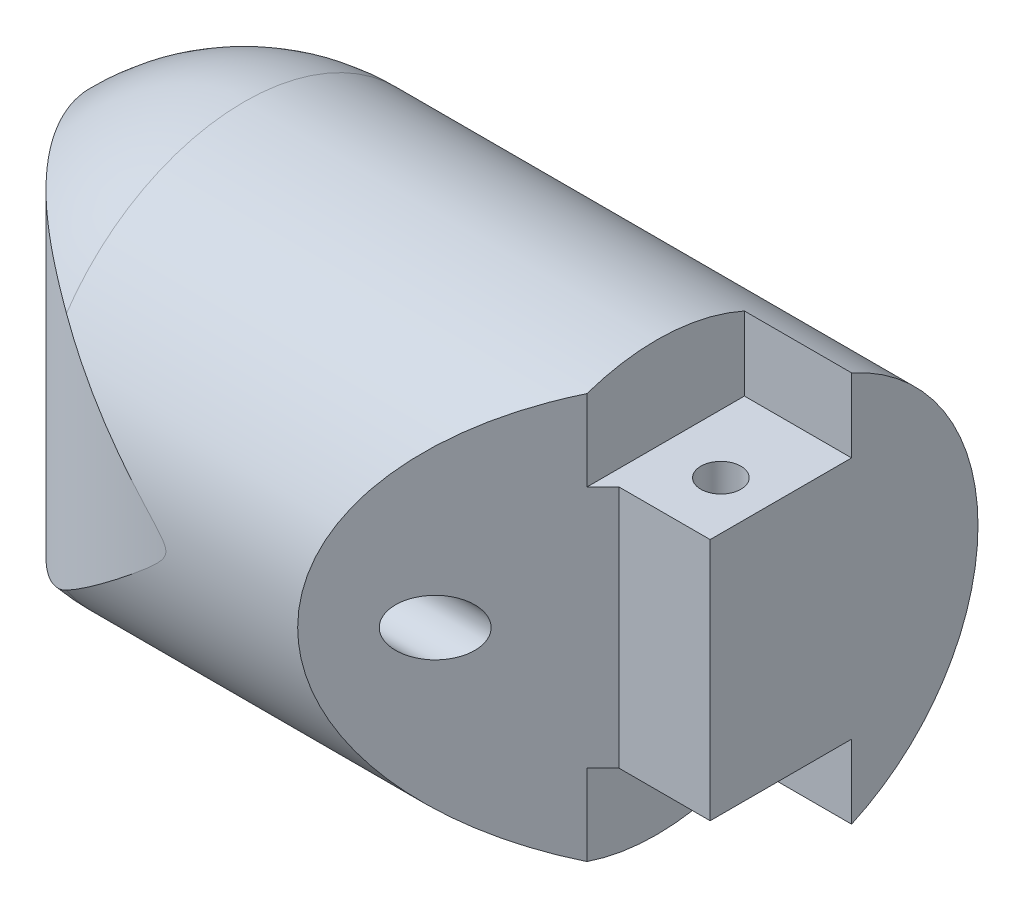
ISO-10303-21;
HEADER;
FILE_DESCRIPTION(('STEP AP214'),'2;1');
FILE_NAME('part.step','',(''),(''),'','','');
FILE_SCHEMA(('AUTOMOTIVE_DESIGN { 1 0 10303 214 1 1 1 1 }'));
ENDSEC;
DATA;
#1=APPLICATION_CONTEXT('core data for automotive mechanical design processes');
#2=APPLICATION_PROTOCOL_DEFINITION('international standard','automotive_design',2000,#1);
#3=PRODUCT_CONTEXT('',#1,'mechanical');
#4=PRODUCT('Part','Part','',(#3));
#5=PRODUCT_RELATED_PRODUCT_CATEGORY('part','',(#4));
#6=PRODUCT_DEFINITION_FORMATION('','',#4);
#7=PRODUCT_DEFINITION_CONTEXT('part definition',#1,'design');
#8=PRODUCT_DEFINITION('design','',#6,#7);
#9=PRODUCT_DEFINITION_SHAPE('','',#8);
#10=(LENGTH_UNIT() NAMED_UNIT(*) SI_UNIT(.MILLI.,.METRE.));
#11=(NAMED_UNIT(*) PLANE_ANGLE_UNIT() SI_UNIT($,.RADIAN.));
#12=(NAMED_UNIT(*) SI_UNIT($,.STERADIAN.) SOLID_ANGLE_UNIT());
#13=UNCERTAINTY_MEASURE_WITH_UNIT(LENGTH_MEASURE(1.E-05),#10,'distance_accuracy_value','');
#14=(GEOMETRIC_REPRESENTATION_CONTEXT(3) GLOBAL_UNCERTAINTY_ASSIGNED_CONTEXT((#13)) GLOBAL_UNIT_ASSIGNED_CONTEXT((#10,
#11,#12)) REPRESENTATION_CONTEXT('',''));
#15=CARTESIAN_POINT('',(0.,0.,0.));
#16=DIRECTION('',(0.,0.,1.));
#17=DIRECTION('',(1.,0.,0.));
#18=AXIS2_PLACEMENT_3D('',#15,#16,#17);
#19=CARTESIAN_POINT('',(17.6101649936008,1.61811043714822E-05,-0.164751686969172));
#20=DIRECTION('',(-1.,0.,0.));
#21=DIRECTION('',(0.,0.,1.));
#22=AXIS2_PLACEMENT_3D('',#19,#20,#21);
#23=CYLINDRICAL_SURFACE('',#22,8.);
#24=CARTESIAN_POINT('',(7.70519221882629,1.61811043714822E-05,7.83524831303083));
#25=VERTEX_POINT('',#24);
#26=VERTEX_LOOP('',#25);
#27=FACE_BOUND('',#26,.T.);
#28=DIRECTION('',(-1.,0.,0.));
#29=VECTOR('',#28,1.);
#30=CARTESIAN_POINT('',(17.6101649936008,-7.29666799734271,-3.44475168696917));
#31=LINE('',#30,#29);
#32=CARTESIAN_POINT('',(17.0101649936008,-7.29666799734271,-3.44475168696917));
#33=VERTEX_POINT('',#32);
#34=CARTESIAN_POINT('',(21.0101649936008,-7.29666799734271,-3.44475168696917));
#35=VERTEX_POINT('',#34);
#36=EDGE_CURVE('E139',#33,#35,#31,.F.);
#37=ORIENTED_EDGE('',*,*,#36,.F.);
#38=CARTESIAN_POINT('',(17.0101649936008,1.61811043714822E-05,-0.164751686969172));
#39=DIRECTION('',(1.,0.,0.));
#40=DIRECTION('',(0.,0.,-1.));
#41=AXIS2_PLACEMENT_3D('',#38,#39,#40);
#42=CIRCLE('',#41,8.);
#43=CARTESIAN_POINT('',(17.0101649936008,-7.56569594664672,2.43524831303084));
#44=VERTEX_POINT('',#43);
#45=EDGE_CURVE('E173',#44,#33,#42,.T.);
#46=ORIENTED_EDGE('',*,*,#45,.F.);
#47=CARTESIAN_POINT('',(19.6101649936008,1.61811043714822E-05,-0.164751686969172));
#48=DIRECTION('',(-0.707106781186552,0.,-0.707106781186544));
#49=DIRECTION('',(-0.707106781186544,0.,0.707106781186552));
#50=AXIS2_PLACEMENT_3D('',#47,#48,#49);
#51=ELLIPSE('',#50,11.3137084989847,8.);
#52=CARTESIAN_POINT('',(17.0101649936008,7.56572830885546,2.43524831303083));
#53=VERTEX_POINT('',#52);
#54=EDGE_CURVE('E53',#44,#53,#51,.T.);
#55=ORIENTED_EDGE('',*,*,#54,.T.);
#56=CARTESIAN_POINT('',(17.0101649936008,1.61811043714822E-05,-0.164751686969172));
#57=DIRECTION('',(1.,0.,0.));
#58=DIRECTION('',(0.,0.,-1.));
#59=AXIS2_PLACEMENT_3D('',#56,#57,#58);
#60=CIRCLE('',#59,8.);
#61=CARTESIAN_POINT('',(17.0101649936008,7.29670035955145,-3.44475168696917));
#62=VERTEX_POINT('',#61);
#63=EDGE_CURVE('E176',#62,#53,#60,.T.);
#64=ORIENTED_EDGE('',*,*,#63,.F.);
#65=DIRECTION('',(-1.,0.,0.));
#66=VECTOR('',#65,1.);
#67=CARTESIAN_POINT('',(17.6101649936008,7.29670035955145,-3.44475168696917));
#68=LINE('',#67,#66);
#69=CARTESIAN_POINT('',(21.0101649936008,7.29670035955145,-3.44475168696917));
#70=VERTEX_POINT('',#69);
#71=EDGE_CURVE('E159',#70,#62,#68,.T.);
#72=ORIENTED_EDGE('',*,*,#71,.F.);
#73=CARTESIAN_POINT('',(21.0101649936008,1.61811043714822E-05,-0.164751686969172));
#74=DIRECTION('',(1.,0.,0.));
#75=DIRECTION('',(0.,0.,-1.));
#76=AXIS2_PLACEMENT_3D('',#73,#74,#75);
#77=CIRCLE('',#76,8.);
#78=EDGE_CURVE('E185',#35,#70,#77,.T.);
#79=ORIENTED_EDGE('',*,*,#78,.F.);
#80=EDGE_LOOP('',(#37,#46,#55,#64,#72,#79));
#81=FACE_BOUND('',#80,.T.);
#82=CARTESIAN_POINT('',(1.61016499360084,1.71233530639071,-7.97935105054365));
#83=CARTESIAN_POINT('',(1.65725298118821,1.74075268129366,-7.97312301153596));
#84=CARTESIAN_POINT('',(1.70551800427946,1.76723142689343,-7.96716012932537));
#85=CARTESIAN_POINT('',(1.80413430495993,1.81615260314322,-7.95591855086394));
#86=CARTESIAN_POINT('',(1.8544858033116,1.83859460533137,-7.95063992725722));
#87=CARTESIAN_POINT('',(2.00815517248654,1.8995796656265,-7.93607247873761));
#88=CARTESIAN_POINT('',(2.11417865634026,1.93183651749961,-7.92803962544227));
#89=CARTESIAN_POINT('',(2.3304192470671,1.9784467364772,-7.91629336351326));
#90=CARTESIAN_POINT('',(2.44064143145067,1.99277766859026,-7.91258536799974));
#91=CARTESIAN_POINT('',(2.66194610572474,2.00299330831693,-7.90995105049467));
#92=CARTESIAN_POINT('',(2.77302803693621,1.99888913076955,-7.91102184728601));
#93=CARTESIAN_POINT('',(2.99116554098636,1.97259850098586,-7.91775710042299));
#94=CARTESIAN_POINT('',(3.09825659184325,1.95068623866359,-7.92335189454791));
#95=CARTESIAN_POINT('',(3.30723007269595,1.88983847261616,-7.9383959570226));
#96=CARTESIAN_POINT('',(3.40911064161346,1.85089693315935,-7.94784659192855));
#97=CARTESIAN_POINT('',(3.60614285830818,1.75659301793362,-7.9696730061742));
#98=CARTESIAN_POINT('',(3.7011985120869,1.70103822798487,-7.98208269565912));
#99=CARTESIAN_POINT('',(3.88079705995276,1.57524253597031,-8.00839754481537));
#100=CARTESIAN_POINT('',(3.96533912818908,1.50500048136832,-8.02230282180655));
#101=CARTESIAN_POINT('',(4.1240139925016,1.349469363457,-8.05052265156782));
#102=CARTESIAN_POINT('',(4.19778607628721,1.26381187792453,-8.06483768937494));
#103=CARTESIAN_POINT('',(4.32997208057947,1.08113581979395,-8.09190082120018));
#104=CARTESIAN_POINT('',(4.38838532796698,0.984116749530231,-8.10464884652908));
#105=CARTESIAN_POINT('',(4.48819323821953,0.781188947822655,-8.12717542834386));
#106=CARTESIAN_POINT('',(4.52956513873233,0.675268552529758,-8.13695000863527));
#107=CARTESIAN_POINT('',(4.59382016060902,0.457679949069797,-8.1523936223264));
#108=CARTESIAN_POINT('',(4.61670701028231,0.346012904798323,-8.15806348359618));
#109=CARTESIAN_POINT('',(4.6428541823851,0.123237345479737,-8.16455851049811));
#110=CARTESIAN_POINT('',(4.64661263300471,0.0121907416368236,-8.16550662225228));
#111=CARTESIAN_POINT('',(4.63572057996783,-0.208931447926665,-8.16278671717604));
#112=CARTESIAN_POINT('',(4.62107151508548,-0.319007108861211,-8.15911906112471));
#113=CARTESIAN_POINT('',(4.57417779959749,-0.533583397207488,-8.14765053606749));
#114=CARTESIAN_POINT('',(4.54216670183946,-0.638138247711567,-8.13990456781774));
#115=CARTESIAN_POINT('',(4.46170520164669,-0.84040042417791,-8.12113444149895));
#116=CARTESIAN_POINT('',(4.41325292568124,-0.938106968219617,-8.11010990984364));
#117=CARTESIAN_POINT('',(4.30021782929956,-1.12596078595223,-8.08569405073444));
#118=CARTESIAN_POINT('',(4.23534352068081,-1.21592718585016,-8.07226139348109));
#119=CARTESIAN_POINT('',(4.09171577167165,-1.38386932633363,-8.04460685967782));
#120=CARTESIAN_POINT('',(4.01296020566616,-1.46184322709744,-8.03038486248635));
#121=CARTESIAN_POINT('',(3.84158131391911,-1.60547529953047,-8.00234626858984));
#122=CARTESIAN_POINT('',(3.74867438974016,-1.6707991031831,-7.98854717983906));
#123=CARTESIAN_POINT('',(3.55290543007635,-1.78491413469106,-7.96330628490074));
#124=CARTESIAN_POINT('',(3.45004358459077,-1.83370567800057,-7.95186443373607));
#125=CARTESIAN_POINT('',(3.23807924114389,-1.91290701155149,-7.93278763036897));
#126=CARTESIAN_POINT('',(3.12903385334455,-1.9434620746124,-7.92512267907399));
#127=CARTESIAN_POINT('',(2.9071458090494,-1.98575404953757,-7.91440991300598));
#128=CARTESIAN_POINT('',(2.79430424686238,-1.99749633782719,-7.91136077911125));
#129=CARTESIAN_POINT('',(2.57148440207691,-2.00169998467868,-7.91027511913483));
#130=CARTESIAN_POINT('',(2.46151641736342,-1.99470259110886,-7.91209787785252));
#131=CARTESIAN_POINT('',(2.24436721410341,-1.96280204191048,-7.9202407507275));
#132=CARTESIAN_POINT('',(2.13718567245812,-1.93790097196375,-7.92656034102727));
#133=CARTESIAN_POINT('',(1.95885622751173,-1.88073034096929,-7.94057200488853));
#134=CARTESIAN_POINT('',(1.8862495683072,-1.85267260119402,-7.94733901993949));
#135=CARTESIAN_POINT('',(1.74503179734006,-1.78845043185946,-7.96234366957772));
#136=CARTESIAN_POINT('',(1.67641375926189,-1.75230061838877,-7.97057864730273));
#137=CARTESIAN_POINT('',(1.61016499360084,-1.71230294418197,-7.97935105054365));
#138=B_SPLINE_CURVE_WITH_KNOTS('',3,(#82,#83,#84,#85,#86,#87,#88,#89,#90,#91,#92,#93,#94,#95,
#96,#97,#98,#99,#100,#101,#102,#103,#104,#105,#106,#107,#108,#109,#110,#111,#112,#113,#114,#115,
#116,#117,#118,#119,#120,#121,#122,#123,#124,#125,#126,#127,#128,#129,#130,#131,#132,#133,#134,
#135,#136,#137),.UNSPECIFIED.,.F.,.F.,(4,2,2,2,2,2,2,2,2,2,2,2,2,2,2,2,2,2,2,2,2,2,2,2,2,2,2,4),
(0.,0.165953676128632,0.33192495627823,0.663551399347728,0.995592471988016,1.32743337833735,
1.65425962707504,1.98120180770854,2.31208781261516,2.64299979249547,2.98324217287823,
3.32349946230035,3.6642097755077,4.004851352583,4.33657507772737,4.66827287618812,
4.99561553137389,5.32299550095291,5.65665298089313,5.99036159773628,6.33195175535411,
6.67353539467921,7.01236032584674,7.35108840834994,7.68013946111097,8.00915218740687,
8.24304145915841,8.47651163554166),.UNSPECIFIED.);
#139=CARTESIAN_POINT('',(1.61016499360081,1.71233530639076,-7.97935105054365));
#140=VERTEX_POINT('',#139);
#141=CARTESIAN_POINT('',(1.61016499360084,-1.71230294418197,-7.97935105054365));
#142=VERTEX_POINT('',#141);
#143=EDGE_CURVE('E60',#140,#142,#138,.T.);
#144=ORIENTED_EDGE('',*,*,#143,.F.);
#145=CARTESIAN_POINT('',(1.61016499360084,1.61811043714822E-05,-0.164751686969172));
#146=DIRECTION('',(1.,0.,0.));
#147=DIRECTION('',(0.,0.,-1.));
#148=AXIS2_PLACEMENT_3D('',#145,#146,#147);
#149=CIRCLE('',#148,8.);
#150=CARTESIAN_POINT('',(1.61016499360084,4.47531782740553,6.46636248597447));
#151=VERTEX_POINT('',#150);
#152=EDGE_CURVE('E249',#140,#151,#149,.T.);
#153=ORIENTED_EDGE('',*,*,#152,.T.);
#154=CARTESIAN_POINT('',(1.61016499360084,-4.47528546519679,6.46636248597447));
#155=CARTESIAN_POINT('',(1.80213401584356,-4.32567854641755,6.56731529819537));
#156=CARTESIAN_POINT('',(1.99549902341133,-4.17393201223902,6.66237614848055));
#157=CARTESIAN_POINT('',(2.38455397087643,-3.86671474510934,6.84096108557073));
#158=CARTESIAN_POINT('',(2.58024368062027,-3.71124437930682,6.92448630427404));
#159=CARTESIAN_POINT('',(2.97376371317829,-3.39690931292307,7.08036384862137));
#160=CARTESIAN_POINT('',(3.17159639798209,-3.23804062692274,7.15270213282443));
#161=CARTESIAN_POINT('',(3.56872602429099,-2.91751661805304,7.28629870279307));
#162=CARTESIAN_POINT('',(3.76802292029855,-2.75586138156199,7.34755733133503));
#163=CARTESIAN_POINT('',(4.14563661574769,-2.44797370416302,7.4530457490555));
#164=CARTESIAN_POINT('',(4.32385002168903,-2.30200053012769,7.49840743635574));
#165=CARTESIAN_POINT('',(4.68065428986481,-2.00808690783486,7.58062147889897));
#166=CARTESIAN_POINT('',(4.859245198091,-1.86014620668173,7.61747272885409));
#167=CARTESIAN_POINT('',(5.21591119467358,-1.56225818996041,7.68270484473493));
#168=CARTESIAN_POINT('',(5.39398665193591,-1.41231374046635,7.71109668598665));
#169=CARTESIAN_POINT('',(5.65956093915709,-1.18466895457722,7.74741635915713));
#170=CARTESIAN_POINT('',(5.74781762911801,-1.10834296537341,7.75847718516285));
#171=CARTESIAN_POINT('',(5.92329102311056,-0.954241597294268,7.77851279693696));
#172=CARTESIAN_POINT('',(6.01050782254611,-0.876466353083919,7.78748777548879));
#173=CARTESIAN_POINT('',(6.14967695629961,-0.748502621566644,7.80030463787853));
#174=CARTESIAN_POINT('',(6.20233793540122,-0.699161134346354,7.80479575093919));
#175=CARTESIAN_POINT('',(6.3068597068592,-0.597935623699262,7.81303472056146));
#176=CARTESIAN_POINT('',(6.35869391667236,-0.546023436440655,7.8167694290254));
#177=CARTESIAN_POINT('',(6.45996946333775,-0.438097205368494,7.82343116385355));
#178=CARTESIAN_POINT('',(6.50936127031056,-0.382032062671681,7.82634477684155));
#179=CARTESIAN_POINT('',(6.57615975299841,-0.293055630478338,7.82993158873145));
#180=CARTESIAN_POINT('',(6.59707170485955,-0.262844861202245,7.83099114104619));
#181=CARTESIAN_POINT('',(6.63461873004748,-0.199898841624664,7.83281153390283));
#182=CARTESIAN_POINT('',(6.65127924489527,-0.167180208864048,7.83357416644827));
#183=CARTESIAN_POINT('',(6.66774902765042,-0.123106633953972,7.83430688016601));
#184=CARTESIAN_POINT('',(6.67111938382378,-0.113094365923109,7.83445502786565));
#185=CARTESIAN_POINT('',(6.67709696023047,-0.0928424453908621,7.83471581513946));
#186=CARTESIAN_POINT('',(6.67970399505316,-0.0826027382933075,7.83482844608714));
#187=CARTESIAN_POINT('',(6.68620230695076,-0.0516499828138604,7.83510787446901));
#188=CARTESIAN_POINT('',(6.68879658135396,-0.0306377908398137,7.83521733031133));
#189=CARTESIAN_POINT('',(6.68999072253248,0.0115966049167678,7.83526792726771));
#190=CARTESIAN_POINT('',(6.68857217342718,0.0328193300801802,7.83520829237791));
#191=CARTESIAN_POINT('',(6.68199335973271,0.0746971547539586,7.83492730383399));
#192=CARTESIAN_POINT('',(6.67682347473333,0.0953506528329866,7.83470553436996));
#193=CARTESIAN_POINT('',(6.6601935624995,0.146024815155526,7.83397420114377));
#194=CARTESIAN_POINT('',(6.64686670606852,0.175408977646341,7.83337532873784));
#195=CARTESIAN_POINT('',(6.6162854077636,0.232066114114863,7.83193265767974));
#196=CARTESIAN_POINT('',(6.59901340918607,0.259328897546218,7.83108775939648));
#197=CARTESIAN_POINT('',(6.5433397269479,0.339557796487792,7.82822182343742));
#198=CARTESIAN_POINT('',(6.50150279510386,0.390065848730843,7.8258858891344));
#199=CARTESIAN_POINT('',(6.41425829648675,0.487910481525721,7.82050552197558));
#200=CARTESIAN_POINT('',(6.36883931598877,0.535235954384343,7.81745875836704));
#201=CARTESIAN_POINT('',(6.22958198124902,0.674947927535177,7.80727828374814));
#202=CARTESIAN_POINT('',(6.13311622055641,0.764634376136404,7.79912210098064));
#203=CARTESIAN_POINT('',(5.84270350638561,1.02787213621334,7.77088867837542));
#204=CARTESIAN_POINT('',(5.64576658063189,1.19758065107802,7.74695738446443));
#205=CARTESIAN_POINT('',(5.25022514812977,1.53363040606878,7.68871169407128));
#206=CARTESIAN_POINT('',(5.0516191457879,1.69996803631812,7.65438673536339));
#207=CARTESIAN_POINT('',(4.65528010009374,2.02924966360804,7.57545361062191));
#208=CARTESIAN_POINT('',(4.45754742714262,2.19220609099918,7.53089543752892));
#209=CARTESIAN_POINT('',(4.06286630108253,2.51571489440394,7.43129124335486));
#210=CARTESIAN_POINT('',(3.86591760879371,2.67626805275948,7.37624871904001));
#211=CARTESIAN_POINT('',(3.4956276431109,2.97664653751983,7.26239073295578));
#212=CARTESIAN_POINT('',(3.3221564019935,3.11674699588992,7.20472204616289));
#213=CARTESIAN_POINT('',(2.97644891309551,3.39471761733661,7.08087807260623));
#214=CARTESIAN_POINT('',(2.80421272048135,3.5325876811285,7.01470240832599));
#215=CARTESIAN_POINT('',(2.46056996455086,3.80634839074364,6.87340628172035));
#216=CARTESIAN_POINT('',(2.28916966630594,3.94222864734924,6.79825037707639));
#217=CARTESIAN_POINT('',(1.94820877444614,4.21106325800459,6.63903087063321));
#218=CARTESIAN_POINT('',(1.77864827597713,4.34401746109467,6.55496681054333));
#219=CARTESIAN_POINT('',(1.61016499360084,4.47531782740553,6.46636248597447));
#220=B_SPLINE_CURVE_WITH_KNOTS('',3,(#154,#155,#156,#157,#158,#159,#160,#161,#162,#163,#164,
#165,#166,#167,#168,#169,#170,#171,#172,#173,#174,#175,#176,#177,#178,#179,#180,#181,#182,#183,
#184,#185,#186,#187,#188,#189,#190,#191,#192,#193,#194,#195,#196,#197,#198,#199,#200,#201,#202,
#203,#204,#205,#206,#207,#208,#209,#210,#211,#212,#213,#214,#215,#216,#217,#218,#219),
.UNSPECIFIED.,.F.,.F.,(4,2,2,2,2,2,2,2,2,2,2,2,2,2,2,2,2,2,2,2,2,2,2,2,2,2,2,2,2,2,2,2,4),(0.,
0.790347956737832,1.58061830783697,2.37187266516026,3.16310253889596,3.86730710463683,
4.57160307714849,5.27498126941964,5.62657722729656,5.97814067615178,6.19501186926937,
6.41537896921742,6.63916105284025,6.74929969246744,6.8587629065912,6.89043127660431,
6.92210733249045,6.98525065388525,7.04868422572916,7.112281052369,7.20853796750391,
7.30523189291532,7.5015504216489,7.69852194187429,8.09418094720072,8.87713545938584,
9.66088830933825,10.440890762936,11.2206335223028,11.9114222108256,12.6022415652565,
13.2958835009273,13.9895611391731),.UNSPECIFIED.);
#221=CARTESIAN_POINT('',(1.61016499360084,-4.47528546519679,6.46636248597448));
#222=VERTEX_POINT('',#221);
#223=EDGE_CURVE('E244',#222,#151,#220,.T.);
#224=ORIENTED_EDGE('',*,*,#223,.F.);
#225=EDGE_CURVE('E251',#222,#142,#149,.T.);
#226=ORIENTED_EDGE('',*,*,#225,.T.);
#227=EDGE_LOOP('',(#144,#153,#224,#226));
#228=FACE_BOUND('',#227,.T.);
#229=ADVANCED_FACE('F39',(#27,#81,#228),#23,.T.);
#230=CARTESIAN_POINT('',(1.61016499360085,1.61811043714822E-05,-0.164751686969172));
#231=DIRECTION('',(0.,1.,0.));
#232=DIRECTION('',(-1.,0.,0.));
#233=AXIS2_PLACEMENT_3D('',#230,#231,#232);
#234=SPHERICAL_SURFACE('',#233,8.);
#235=ORIENTED_EDGE('',*,*,#152,.F.);
#236=CARTESIAN_POINT('',(2.11798098571633,1.92971491773069,-7.91190508057218));
#237=CARTESIAN_POINT('',(2.0635833137763,1.91489757196481,-7.91916144716692));
#238=CARTESIAN_POINT('',(2.00982629292198,1.89778357553982,-7.92632205310035));
#239=CARTESIAN_POINT('',(1.90392228202673,1.8590688294976,-7.94040996156137));
#240=CARTESIAN_POINT('',(1.85177527411223,1.83746812971016,-7.94733726667903));
#241=CARTESIAN_POINT('',(1.69836978396877,1.7661552958558,-7.96768965350499));
#242=CARTESIAN_POINT('',(1.60000782806401,1.70989446180817,-7.98070373903571));
#243=CARTESIAN_POINT('',(1.41404267075822,1.58147501923293,-8.00525353643613));
#244=CARTESIAN_POINT('',(1.32644641438666,1.50930623134966,-8.01678829418754));
#245=CARTESIAN_POINT('',(1.16460537180713,1.35109128760913,-8.03805973358905));
#246=CARTESIAN_POINT('',(1.09035644472852,1.26504945149,-8.04779697292595));
#247=CARTESIAN_POINT('',(0.957794379076196,1.08204824152414,-8.06515598422951));
#248=CARTESIAN_POINT('',(0.899390483040538,0.985155738473425,-8.07278980828897));
#249=CARTESIAN_POINT('',(0.799677508387035,0.782779393426038,-8.08580961503332));
#250=CARTESIAN_POINT('',(0.758370716521238,0.677294404433814,-8.09119529702814));
#251=CARTESIAN_POINT('',(0.694370338838028,0.461644748423761,-8.09953506211925));
#252=CARTESIAN_POINT('',(0.671531567043521,0.351523888645237,-8.10250811274133));
#253=CARTESIAN_POINT('',(0.644606587379233,0.128984942909682,-8.10601273241574));
#254=CARTESIAN_POINT('',(0.640518267180204,0.0165671171502955,-8.10654457648184));
#255=CARTESIAN_POINT('',(0.651187378007772,-0.206840037043114,-8.10515613600312));
#256=CARTESIAN_POINT('',(0.665859168165837,-0.317833537321215,-8.10324699468442));
#257=CARTESIAN_POINT('',(0.71346464026571,-0.535767786372331,-8.0970473427116));
#258=CARTESIAN_POINT('',(0.746399182911573,-0.642708343880679,-8.09275671982077));
#259=CARTESIAN_POINT('',(0.829577688675768,-0.84957303230881,-8.08190687866808));
#260=CARTESIAN_POINT('',(0.879831131460456,-0.949493284462545,-8.07534641798093));
#261=CARTESIAN_POINT('',(0.996169959072261,-1.13946575036786,-8.06013350797537));
#262=CARTESIAN_POINT('',(1.06225515199958,-1.22951808371116,-8.05148108401405));
#263=CARTESIAN_POINT('',(1.20874654841812,-1.39774710281841,-8.03226247506785));
#264=CARTESIAN_POINT('',(1.2892302544212,-1.47585505136753,-8.02168592766808));
#265=CARTESIAN_POINT('',(1.46196512349662,-1.61746057550921,-7.99893311532617));
#266=CARTESIAN_POINT('',(1.55421406522149,-1.68096090277975,-7.98675715235039));
#267=CARTESIAN_POINT('',(1.72444831750497,-1.77828277501233,-7.96422932519712));
#268=CARTESIAN_POINT('',(1.80051457089648,-1.81556878441845,-7.9541448687278));
#269=CARTESIAN_POINT('',(1.95657859613042,-1.88018647991455,-7.93341233807662));
#270=CARTESIAN_POINT('',(2.03657138392828,-1.90753043289048,-7.92276497714398));
#271=CARTESIAN_POINT('',(2.11798098571633,-1.92968255552195,-7.91190508057218));
#272=B_SPLINE_CURVE_WITH_KNOTS('',3,(#236,#237,#238,#239,#240,#241,#242,#243,#244,#245,#246,
#247,#248,#249,#250,#251,#252,#253,#254,#255,#256,#257,#258,#259,#260,#261,#262,#263,#264,#265,
#266,#267,#268,#269,#270,#271),.UNSPECIFIED.,.F.,.F.,(4,2,2,2,2,2,2,2,2,2,2,2,2,2,2,2,2,4),(0.,
0.170430570465811,0.340859248213927,0.681286259418635,1.02193174244394,1.36247136066082,
1.70101714767581,2.0396082008535,2.37551081750098,2.71137559216105,3.04571258675616,
3.38006533963681,3.71460139514236,4.04913339587483,4.38552344011757,4.72185006565443,
4.97713665995373,5.23210719443881),.UNSPECIFIED.);
#273=EDGE_CURVE('E47',#140,#142,#272,.T.);
#274=ORIENTED_EDGE('',*,*,#273,.T.);
#275=ORIENTED_EDGE('',*,*,#225,.F.);
#276=CARTESIAN_POINT('',(1.61032499360068,-4.4751607794264,6.46644663206296));
#277=CARTESIAN_POINT('',(1.52954800612893,-4.53810762433188,6.42396774235228));
#278=CARTESIAN_POINT('',(1.44813262819111,-4.59918095846541,6.37997261573608));
#279=CARTESIAN_POINT('',(1.28432703212657,-4.71762046703394,6.28893124804707));
#280=CARTESIAN_POINT('',(1.20193688347153,-4.77498690379801,6.24188522335283));
#281=CARTESIAN_POINT('',(0.953834451867236,-4.94153508463717,6.09618908440344));
#282=CARTESIAN_POINT('',(0.787097091526689,-5.04523761071607,5.99293235466039));
#283=CARTESIAN_POINT('',(0.45349496207498,-5.23806256552588,5.77441136675883));
#284=CARTESIAN_POINT('',(0.28663063597748,-5.32720366050348,5.65916279629164));
#285=CARTESIAN_POINT('',(-0.0454503051649566,-5.49130028016092,5.41676848353668));
#286=CARTESIAN_POINT('',(-0.210666797065737,-5.56625475207525,5.28962185935975));
#287=CARTESIAN_POINT('',(-0.537477590246057,-5.70208061544204,5.02395232294196));
#288=CARTESIAN_POINT('',(-0.699074470146792,-5.76296234047899,4.88543786000511));
#289=CARTESIAN_POINT('',(-1.01712624739782,-5.87084224076245,4.59752545801724));
#290=CARTESIAN_POINT('',(-1.17358111968622,-5.9178403483498,4.44812746593184));
#291=CARTESIAN_POINT('',(-1.47986834632378,-5.99804352377846,4.13918783224011));
#292=CARTESIAN_POINT('',(-1.62970075742648,-6.0312487098436,3.97964627759124));
#293=CARTESIAN_POINT('',(-1.92143619660413,-6.08392789316647,3.65131184239996));
#294=CARTESIAN_POINT('',(-2.06333912435248,-6.10340171672638,3.48251884485855));
#295=CARTESIAN_POINT('',(-2.34033171896881,-6.12885887320929,3.13388546817821));
#296=CARTESIAN_POINT('',(-2.47527132944045,-6.1346155362854,2.95390923720223));
#297=CARTESIAN_POINT('',(-2.73477162515943,-6.13198756052868,2.58672082685375));
#298=CARTESIAN_POINT('',(-2.8593321833596,-6.12360274862053,2.39950855894791));
#299=CARTESIAN_POINT('',(-3.09726887564207,-6.09267564481086,2.01921806482911));
#300=CARTESIAN_POINT('',(-3.21064419218685,-6.07013231893889,1.82613941118475));
#301=CARTESIAN_POINT('',(-3.42558984960434,-6.01084627921888,1.43564106893847));
#302=CARTESIAN_POINT('',(-3.52716023075548,-5.97410361382082,1.23822139515084));
#303=CARTESIAN_POINT('',(-3.71809730009482,-5.88634884481689,0.840672564506474));
#304=CARTESIAN_POINT('',(-3.80746409842751,-5.83533687001257,0.640543432122107));
#305=CARTESIAN_POINT('',(-3.97381564602349,-5.71893827189183,0.239317248208087));
#306=CARTESIAN_POINT('',(-4.05080024769557,-5.65355147725485,0.0382201851704816));
#307=CARTESIAN_POINT('',(-4.19246977118641,-5.50821952531209,-0.363189021906106));
#308=CARTESIAN_POINT('',(-4.25714776570597,-5.4282662178934,-0.563500662075356));
#309=CARTESIAN_POINT('',(-4.37442437110244,-5.25364226362681,-0.961224807226229));
#310=CARTESIAN_POINT('',(-4.42702328389217,-5.15897198472416,-1.15863738455354));
#311=CARTESIAN_POINT('',(-4.5204752800023,-4.95508548158123,-1.54765712130877));
#312=CARTESIAN_POINT('',(-4.56137351555666,-4.84592762001684,-1.73928397320286));
#313=CARTESIAN_POINT('',(-4.63245774311188,-4.61251796125048,-2.11524359393822));
#314=CARTESIAN_POINT('',(-4.66264241291386,-4.48826430356135,-2.29957545998713));
#315=CARTESIAN_POINT('',(-4.71327542699564,-4.22456655397672,-2.65816249107272));
#316=CARTESIAN_POINT('',(-4.73373519162064,-4.08514051736851,-2.83242926352612));
#317=CARTESIAN_POINT('',(-4.76624794543997,-3.79089729237711,-3.16815448843756));
#318=CARTESIAN_POINT('',(-4.7783046600937,-3.63608695938895,-3.32961858873583));
#319=CARTESIAN_POINT('',(-4.79890615910192,-3.24801539008701,-3.69608244369888));
#320=CARTESIAN_POINT('',(-4.80429252068503,-3.00755880368793,-3.89378884203963));
#321=CARTESIAN_POINT('',(-4.8068470880075,-2.49835060966063,-4.24839612483797));
#322=CARTESIAN_POINT('',(-4.80402834012531,-2.229644574664,-4.40536135657468));
#323=CARTESIAN_POINT('',(-4.79640435122581,-1.71331346165794,-4.64671897741269));
#324=CARTESIAN_POINT('',(-4.79199231993339,-1.4692667072732,-4.73872932876129));
#325=CARTESIAN_POINT('',(-4.78427739995413,-0.969147778044819,-4.88060789810472));
#326=CARTESIAN_POINT('',(-4.78097380276493,-0.713083404555505,-4.93050306682928));
#327=CARTESIAN_POINT('',(-4.77737664632059,-0.195200616124311,-4.98442092522241));
#328=CARTESIAN_POINT('',(-4.77709321063494,0.066634204993238,-4.98828933843593));
#329=CARTESIAN_POINT('',(-4.77972404226151,0.586788586137389,-4.94941830845663));
#330=CARTESIAN_POINT('',(-4.78263872066876,0.845107689921638,-4.90667287338664));
#331=CARTESIAN_POINT('',(-4.7898008140921,1.33794747129549,-4.78122888072201));
#332=CARTESIAN_POINT('',(-4.79397486177762,1.57301293888479,-4.7006196931296));
#333=CARTESIAN_POINT('',(-4.80122612044054,2.02857222080183,-4.50531220873093));
#334=CARTESIAN_POINT('',(-4.80430271939509,2.24905784862027,-4.39059495578722));
#335=CARTESIAN_POINT('',(-4.80620196703979,2.60748544994956,-4.17235909832299));
#336=CARTESIAN_POINT('',(-4.80603996355874,2.75000224238165,-4.07619826485699));
#337=CARTESIAN_POINT('',(-4.80292309196355,3.02628075931012,-3.87197747132461));
#338=CARTESIAN_POINT('',(-4.79996732407802,3.16003964835911,-3.76391368765086));
#339=CARTESIAN_POINT('',(-4.79040590162788,3.41860547201113,-3.53751463110388));
#340=CARTESIAN_POINT('',(-4.78379674527624,3.54340368789935,-3.41916959548079));
#341=CARTESIAN_POINT('',(-4.76615634100358,3.78389557330405,-3.17380166916843));
#342=CARTESIAN_POINT('',(-4.75512334035906,3.89958561240784,-3.04677535553124));
#343=CARTESIAN_POINT('',(-4.72775879094037,4.12350550436097,-2.78354039593603));
#344=CARTESIAN_POINT('',(-4.71135013788808,4.23159718538266,-2.64722247866514));
#345=CARTESIAN_POINT('',(-4.67267625559507,4.43850219278078,-2.36844544357314));
#346=CARTESIAN_POINT('',(-4.65040883943281,4.53731203576318,-2.22598404919152));
#347=CARTESIAN_POINT('',(-4.59953039647845,4.72568120127795,-1.93626525186664));
#348=CARTESIAN_POINT('',(-4.57092230423925,4.81524477509594,-1.78901009435279));
#349=CARTESIAN_POINT('',(-4.50695270536567,4.98529883058344,-1.49077008446028));
#350=CARTESIAN_POINT('',(-4.47159060935178,5.06578851945646,-1.33978490758809));
#351=CARTESIAN_POINT('',(-4.38599320992062,5.23305685535658,-1.00458110117451));
#352=CARTESIAN_POINT('',(-4.33419735865571,5.31785942193447,-0.819770184141929));
#353=CARTESIAN_POINT('',(-4.22004406936265,5.47472202729532,-0.448004044671667));
#354=CARTESIAN_POINT('',(-4.15768547535584,5.54678066962653,-0.261048589627341));
#355=CARTESIAN_POINT('',(-4.02217964993634,5.67833249621213,0.113513236080808));
#356=CARTESIAN_POINT('',(-3.9490260361995,5.73781819602902,0.301119927258813));
#357=CARTESIAN_POINT('',(-3.79194424262372,5.84428150889546,0.675367721467672));
#358=CARTESIAN_POINT('',(-3.70801588183439,5.89125891184077,0.862008808227453));
#359=CARTESIAN_POINT('',(-3.52372854203183,5.9754418828205,1.24498248022892));
#360=CARTESIAN_POINT('',(-3.42265599021233,6.01181328411011,1.44115597881387));
#361=CARTESIAN_POINT('',(-3.20885036712436,6.07053121073245,1.82920928006008));
#362=CARTESIAN_POINT('',(-3.09611671159482,6.09287703293899,2.02108886699528));
#363=CARTESIAN_POINT('',(-2.85960021324968,6.12358093461375,2.3990507472812));
#364=CARTESIAN_POINT('',(-2.73581824136203,6.13194011561122,2.58513349603372));
#365=CARTESIAN_POINT('',(-2.47799767629695,6.13468849056144,2.95015634419751));
#366=CARTESIAN_POINT('',(-2.34395918423987,6.12907782222752,3.12909651400193));
#367=CARTESIAN_POINT('',(-2.0657366793792,6.10379737200728,3.47971862197014));
#368=CARTESIAN_POINT('',(-1.92149394011275,6.0840390258506,3.6513475851959));
#369=CARTESIAN_POINT('',(-1.62481649205504,6.03032964652514,3.98504090575516));
#370=CARTESIAN_POINT('',(-1.47238168441634,5.99637844206843,4.14710514762892));
#371=CARTESIAN_POINT('',(-1.16069592912796,5.91421787714106,4.46073368323678));
#372=CARTESIAN_POINT('',(-1.00144478658986,5.86600810876517,4.61229767642942));
#373=CARTESIAN_POINT('',(-0.677690392843834,5.75523396882762,4.90414866712932));
#374=CARTESIAN_POINT('',(-0.513187230013924,5.69266983870354,5.04443585425667));
#375=CARTESIAN_POINT('',(-0.185515177220197,5.55508618117838,5.30922231432099));
#376=CARTESIAN_POINT('',(-0.0224470197206149,5.48048258734047,5.43406245634213));
#377=CARTESIAN_POINT('',(0.305210502822624,5.31746784244489,5.67215314523989));
#378=CARTESIAN_POINT('',(0.46979971604077,5.22905805575422,5.78540483549148));
#379=CARTESIAN_POINT('',(0.798755019411813,5.03810939590211,6.00022738348513));
#380=CARTESIAN_POINT('',(0.96312070456412,4.93555604941061,6.10178607772045));
#381=CARTESIAN_POINT('',(1.20769851535929,4.77103306564391,6.24519198866439));
#382=CARTESIAN_POINT('',(1.28891926437282,4.71439193451377,6.29151740670628));
#383=CARTESIAN_POINT('',(1.45040871063431,4.59750555601225,6.38120229456211));
#384=CARTESIAN_POINT('',(1.53067734192487,4.53726006067777,6.42456155987803));
#385=CARTESIAN_POINT('',(1.61032499360067,4.47519314163515,6.46644663206296));
#386=B_SPLINE_CURVE_WITH_KNOTS('',3,(#276,#277,#278,#279,#280,#281,#282,#283,#284,#285,#286,
#287,#288,#289,#290,#291,#292,#293,#294,#295,#296,#297,#298,#299,#300,#301,#302,#303,#304,#305,
#306,#307,#308,#309,#310,#311,#312,#313,#314,#315,#316,#317,#318,#319,#320,#321,#322,#323,#324,
#325,#326,#327,#328,#329,#330,#331,#332,#333,#334,#335,#336,#337,#338,#339,#340,#341,#342,#343,
#344,#345,#346,#347,#348,#349,#350,#351,#352,#353,#354,#355,#356,#357,#358,#359,#360,#361,#362,
#363,#364,#365,#366,#367,#368,#369,#370,#371,#372,#373,#374,#375,#376,#377,#378,#379,#380,#381,
#382,#383,#384,#385),.UNSPECIFIED.,.F.,.F.,(4,2,2,2,2,2,2,2,2,2,2,2,2,2,2,2,2,2,2,2,2,2,2,2,2,2,
2,2,2,2,2,2,2,2,2,2,2,2,2,2,2,2,2,2,2,2,2,2,2,2,2,2,2,2,4),(0.,0.33254252924866,
0.665061499353749,1.32971899105246,1.99351765853064,2.65736556609828,3.32072445212153,
3.9840865708449,4.64744300354781,5.31080782737021,5.98506066638044,6.65932175752591,
7.33363209445505,8.00794013057033,8.68224208025782,9.35655206677927,10.0312405018105,
10.7059120713815,11.3779438787764,12.0500585951685,12.7213820582903,13.3924077031247,
14.3227848929405,15.2516835626369,16.0309269896891,16.8096713773441,17.5910252952219,
18.3724796624038,19.115129078698,19.858192009011,20.3733383159349,20.8886505895734,
21.4044576506454,21.920469276308,22.4442323455431,22.9681911997527,23.4919080630255,
24.0156706486791,24.6444740500193,25.2733463116467,25.9025918813401,26.5318480199251,
27.2020263310227,27.8722382366189,28.5423973566491,29.2125498703457,29.886934623167,
30.5613275151034,31.2357397017597,31.9101405457655,32.564895313408,33.2195854172324,
33.8749505167903,34.2028232632341,34.5307185917558),.UNSPECIFIED.);
#387=EDGE_CURVE('E225',#222,#151,#386,.T.);
#388=ORIENTED_EDGE('',*,*,#387,.T.);
#389=EDGE_LOOP('',(#235,#274,#275,#388));
#390=FACE_BOUND('',#389,.T.);
#391=ADVANCED_FACE('F231',(#390),#234,.T.);
#392=CARTESIAN_POINT('',(7.19736004359885,9.60001618110437,-4.15724323268306));
#393=DIRECTION('',(0.,-1.,0.));
#394=DIRECTION('',(0.,0.,-1.));
#395=AXIS2_PLACEMENT_3D('',#392,#393,#394);
#396=CYLINDRICAL_SURFACE('',#395,12.0032390208733);
#397=ORIENTED_EDGE('',*,*,#223,.T.);
#398=ORIENTED_EDGE('',*,*,#387,.F.);
#399=EDGE_LOOP('',(#397,#398));
#400=FACE_BOUND('',#399,.T.);
#401=ADVANCED_FACE('F234',(#400),#396,.T.);
#402=CARTESIAN_POINT('',(2.64358804984579,1.61811043714822E-05,-2.73217015261755));
#403=DIRECTION('',(0.,0.,-1.));
#404=DIRECTION('',(-1.,0.,0.));
#405=AXIS2_PLACEMENT_3D('',#402,#403,#404);
#406=CYLINDRICAL_SURFACE('',#405,1.044);
#407=CARTESIAN_POINT('',(2.64358804984579,1.61811043714822E-05,-2.73217015261755));
#408=DIRECTION('',(0.,0.,1.));
#409=DIRECTION('',(1.,0.,0.));
#410=AXIS2_PLACEMENT_3D('',#407,#408,#409);
#411=CIRCLE('',#410,1.044);
#412=CARTESIAN_POINT('',(1.59958804984578,1.61811043714822E-05,-2.73217015261756));
#413=VERTEX_POINT('',#412);
#414=EDGE_CURVE('E250',#413,#413,#411,.T.);
#415=ORIENTED_EDGE('',*,*,#414,.T.);
#416=EDGE_LOOP('',(#415));
#417=FACE_BOUND('',#416,.T.);
#418=CARTESIAN_POINT('',(2.64358804984579,1.61811043714822E-05,-5.1321701526175));
#419=DIRECTION('',(0.,0.,1.));
#420=DIRECTION('',(1.,0.,0.));
#421=AXIS2_PLACEMENT_3D('',#418,#419,#420);
#422=CIRCLE('',#421,1.044);
#423=CARTESIAN_POINT('',(3.68758804984579,1.61811043714822E-05,-5.1321701526175));
#424=VERTEX_POINT('',#423);
#425=EDGE_CURVE('E199',#424,#424,#422,.T.);
#426=ORIENTED_EDGE('',*,*,#425,.F.);
#427=EDGE_LOOP('',(#426));
#428=FACE_BOUND('',#427,.T.);
#429=ADVANCED_FACE('F240',(#417,#428),#406,.F.);
#430=CARTESIAN_POINT('',(10.6435880498458,1.61811043714822E-05,-2.7321701526175));
#431=DIRECTION('',(0.,-1.,0.));
#432=DIRECTION('',(0.,0.,-1.));
#433=AXIS2_PLACEMENT_3D('',#430,#431,#432);
#434=TOROIDAL_SURFACE('',#433,8.,1.044);
#435=CARTESIAN_POINT('',(10.6435880498458,1.61811043714822E-05,5.2678298473825));
#436=DIRECTION('',(1.,0.,0.));
#437=DIRECTION('',(0.,0.,-1.));
#438=AXIS2_PLACEMENT_3D('',#435,#436,#437);
#439=CIRCLE('',#438,1.044);
#440=CARTESIAN_POINT('',(10.6435880498458,1.61811043714822E-05,6.3118298473825));
#441=VERTEX_POINT('',#440);
#442=EDGE_CURVE('E207',#441,#441,#439,.T.);
#443=CARTESIAN_POINT('',(10.6435880498458,1.61811043714822E-05,-2.7321701526175));
#444=DIRECTION('',(0.,-1.,0.));
#445=DIRECTION('',(0.,0.,-1.));
#446=AXIS2_PLACEMENT_3D('',#443,#444,#445);
#447=CIRCLE('',#446,9.044);
#448=EDGE_CURVE('',#441,#413,#447,.T.);
#449=ORIENTED_EDGE('',*,*,#442,.T.);
#450=ORIENTED_EDGE('',*,*,#414,.F.);
#451=ORIENTED_EDGE('',*,*,#448,.T.);
#452=ORIENTED_EDGE('',*,*,#448,.F.);
#453=EDGE_LOOP('',(#449,#451,#450,#452));
#454=FACE_BOUND('',#453,.T.);
#455=ADVANCED_FACE('F287',(#454),#434,.F.);
#456=CARTESIAN_POINT('',(10.6435880498458,1.61811043714822E-05,5.2678298473825));
#457=DIRECTION('',(1.,0.,0.));
#458=DIRECTION('',(0.,0.,-1.));
#459=AXIS2_PLACEMENT_3D('',#456,#457,#458);
#460=CYLINDRICAL_SURFACE('',#459,1.044);
#461=CARTESIAN_POINT('',(14.1775834592492,1.61811043714822E-05,5.2678298473825));
#462=DIRECTION('',(-0.707106781186552,0.,-0.707106781186544));
#463=DIRECTION('',(0.707106781186544,0.,-0.707106781186552));
#464=AXIS2_PLACEMENT_3D('',#461,#462,#463);
#465=ELLIPSE('',#464,1.4764389591175,1.044);
#466=CARTESIAN_POINT('',(15.2215834592492,1.61811043714822E-05,4.2238298473825));
#467=VERTEX_POINT('',#466);
#468=EDGE_CURVE('E170',#467,#467,#465,.F.);
#469=ORIENTED_EDGE('',*,*,#468,.T.);
#470=EDGE_LOOP('',(#469));
#471=FACE_BOUND('',#470,.T.);
#472=ORIENTED_EDGE('',*,*,#442,.F.);
#473=EDGE_LOOP('',(#472));
#474=FACE_BOUND('',#473,.T.);
#475=ADVANCED_FACE('F215',(#471,#474),#460,.F.);
#476=CARTESIAN_POINT('',(2.64358804984579,1.61811043714822E-05,-5.1321701526175));
#477=DIRECTION('',(0.,0.,-1.));
#478=DIRECTION('',(-1.,0.,0.));
#479=AXIS2_PLACEMENT_3D('',#476,#477,#478);
#480=CYLINDRICAL_SURFACE('',#479,2.);
#481=CARTESIAN_POINT('',(2.64358804984579,1.61811043714822E-05,-5.1321701526175));
#482=DIRECTION('',(0.,0.,1.));
#483=DIRECTION('',(1.,0.,0.));
#484=AXIS2_PLACEMENT_3D('',#481,#482,#483);
#485=CIRCLE('',#484,2.);
#486=CARTESIAN_POINT('',(4.64358804984579,1.61811043714822E-05,-5.1321701526175));
#487=VERTEX_POINT('',#486);
#488=EDGE_CURVE('E196',#487,#487,#485,.T.);
#489=ORIENTED_EDGE('',*,*,#488,.T.);
#490=EDGE_LOOP('',(#489));
#491=FACE_BOUND('',#490,.T.);
#492=ORIENTED_EDGE('',*,*,#143,.T.);
#493=ORIENTED_EDGE('',*,*,#273,.F.);
#494=EDGE_LOOP('',(#492,#493));
#495=FACE_BOUND('',#494,.T.);
#496=ADVANCED_FACE('F209',(#491,#495),#480,.F.);
#497=CARTESIAN_POINT('',(2.64358804984579,1.61811043714822E-05,-5.1321701526175));
#498=DIRECTION('',(0.,0.,1.));
#499=DIRECTION('',(1.,0.,0.));
#500=AXIS2_PLACEMENT_3D('',#497,#498,#499);
#501=PLANE('',#500);
#502=ORIENTED_EDGE('',*,*,#425,.T.);
#503=EDGE_LOOP('',(#502));
#504=FACE_BOUND('',#503,.T.);
#505=ORIENTED_EDGE('',*,*,#488,.F.);
#506=EDGE_LOOP('',(#505));
#507=FACE_BOUND('',#506,.T.);
#508=ADVANCED_FACE('F214',(#504,#507),#501,.F.);
#509=CARTESIAN_POINT('',(21.0101649936008,-4.54595051131046,1.83524831303083));
#510=DIRECTION('',(0.,1.,0.));
#511=DIRECTION('',(0.,0.,1.));
#512=AXIS2_PLACEMENT_3D('',#509,#510,#511);
#513=PLANE('',#512);
#514=CARTESIAN_POINT('',(19.2101649936008,-4.54595051131046,-0.364751686969172));
#515=DIRECTION('',(0.,1.,0.));
#516=DIRECTION('',(0.,0.,1.));
#517=AXIS2_PLACEMENT_3D('',#514,#515,#516);
#518=CIRCLE('',#517,0.748000000000002);
#519=CARTESIAN_POINT('',(19.2101649936008,-4.54595051131046,0.38324831303083));
#520=VERTEX_POINT('',#519);
#521=EDGE_CURVE('E182',#520,#520,#518,.T.);
#522=ORIENTED_EDGE('',*,*,#521,.T.);
#523=EDGE_LOOP('',(#522));
#524=FACE_BOUND('',#523,.T.);
#525=DIRECTION('',(-1.,0.,0.));
#526=VECTOR('',#525,1.);
#527=CARTESIAN_POINT('',(21.0101649936008,-4.54595051131046,1.83524831303083));
#528=LINE('',#527,#526);
#529=CARTESIAN_POINT('',(21.0101649936008,-4.54595051131046,1.83524831303083));
#530=VERTEX_POINT('',#529);
#531=CARTESIAN_POINT('',(17.6101649936008,-4.54595051131046,1.83524831303083));
#532=VERTEX_POINT('',#531);
#533=EDGE_CURVE('E189',#530,#532,#528,.T.);
#534=ORIENTED_EDGE('',*,*,#533,.T.);
#535=DIRECTION('',(-0.707106781186544,0.,0.707106781186552));
#536=VECTOR('',#535,1.);
#537=CARTESIAN_POINT('',(19.3101649936008,-4.54595051131046,0.135248313030829));
#538=LINE('',#537,#536);
#539=CARTESIAN_POINT('',(17.0101649936008,-4.54595051131046,2.43524831303084));
#540=VERTEX_POINT('',#539);
#541=EDGE_CURVE('E162',#532,#540,#538,.T.);
#542=ORIENTED_EDGE('',*,*,#541,.T.);
#543=DIRECTION('',(0.,0.,1.));
#544=VECTOR('',#543,1.);
#545=CARTESIAN_POINT('',(17.0101649936008,-4.54595051131046,-2.16475168696917));
#546=LINE('',#545,#544);
#547=CARTESIAN_POINT('',(17.0101649936008,-4.54595051131046,-3.44475168696917));
#548=VERTEX_POINT('',#547);
#549=EDGE_CURVE('E144',#548,#540,#546,.T.);
#550=ORIENTED_EDGE('',*,*,#549,.F.);
#551=DIRECTION('',(-1.,0.,0.));
#552=VECTOR('',#551,1.);
#553=CARTESIAN_POINT('',(21.0101649936008,-4.54595051131046,-3.44475168696917));
#554=LINE('',#553,#552);
#555=CARTESIAN_POINT('',(21.0101649936008,-4.54595051131046,-3.44475168696917));
#556=VERTEX_POINT('',#555);
#557=EDGE_CURVE('E136',#556,#548,#554,.T.);
#558=ORIENTED_EDGE('',*,*,#557,.F.);
#559=DIRECTION('',(0.,0.,-1.));
#560=VECTOR('',#559,1.);
#561=CARTESIAN_POINT('',(21.0101649936008,-4.54595051131046,1.83524831303083));
#562=LINE('',#561,#560);
#563=EDGE_CURVE('E118',#530,#556,#562,.T.);
#564=ORIENTED_EDGE('',*,*,#563,.F.);
#565=EDGE_LOOP('',(#534,#542,#550,#558,#564));
#566=FACE_BOUND('',#565,.T.);
#567=ADVANCED_FACE('F141',(#524,#566),#513,.F.);
#568=CARTESIAN_POINT('',(21.0101649936008,4.54598287351921,1.83524831303083));
#569=DIRECTION('',(0.,-1.,0.));
#570=DIRECTION('',(0.,0.,-1.));
#571=AXIS2_PLACEMENT_3D('',#568,#569,#570);
#572=PLANE('',#571);
#573=CARTESIAN_POINT('',(19.2101649936008,4.5459828735192,-0.364751686969172));
#574=DIRECTION('',(0.,-1.,0.));
#575=DIRECTION('',(0.,0.,-1.));
#576=AXIS2_PLACEMENT_3D('',#573,#574,#575);
#577=CIRCLE('',#576,0.748000000000002);
#578=CARTESIAN_POINT('',(19.2101649936008,4.5459828735192,-1.11275168696917));
#579=VERTEX_POINT('',#578);
#580=EDGE_CURVE('E181',#579,#579,#577,.T.);
#581=ORIENTED_EDGE('',*,*,#580,.T.);
#582=EDGE_LOOP('',(#581));
#583=FACE_BOUND('',#582,.T.);
#584=DIRECTION('',(0.,0.,-1.));
#585=VECTOR('',#584,1.);
#586=CARTESIAN_POINT('',(17.0101649936008,4.54598287351921,6.41811902659151));
#587=LINE('',#586,#585);
#588=CARTESIAN_POINT('',(17.0101649936008,4.54598287351921,2.43524831303084));
#589=VERTEX_POINT('',#588);
#590=CARTESIAN_POINT('',(17.0101649936008,4.54598287351921,-3.44475168696917));
#591=VERTEX_POINT('',#590);
#592=EDGE_CURVE('E179',#589,#591,#587,.T.);
#593=ORIENTED_EDGE('',*,*,#592,.F.);
#594=DIRECTION('',(0.707106781186544,0.,-0.707106781186552));
#595=VECTOR('',#594,1.);
#596=CARTESIAN_POINT('',(19.3101649936008,4.54598287351921,0.135248313030829));
#597=LINE('',#596,#595);
#598=CARTESIAN_POINT('',(17.6101649936008,4.5459828735192,1.83524831303083));
#599=VERTEX_POINT('',#598);
#600=EDGE_CURVE('E167',#589,#599,#597,.T.);
#601=ORIENTED_EDGE('',*,*,#600,.T.);
#602=DIRECTION('',(-1.,0.,0.));
#603=VECTOR('',#602,1.);
#604=CARTESIAN_POINT('',(21.0101649936008,4.54598287351921,1.83524831303083));
#605=LINE('',#604,#603);
#606=CARTESIAN_POINT('',(21.0101649936008,4.54598287351921,1.83524831303083));
#607=VERTEX_POINT('',#606);
#608=EDGE_CURVE('E193',#607,#599,#605,.T.);
#609=ORIENTED_EDGE('',*,*,#608,.F.);
#610=DIRECTION('',(0.,0.,1.));
#611=VECTOR('',#610,1.);
#612=CARTESIAN_POINT('',(21.0101649936008,4.54598287351921,1.83524831303083));
#613=LINE('',#612,#611);
#614=CARTESIAN_POINT('',(21.0101649936008,4.54598287351921,-3.44475168696917));
#615=VERTEX_POINT('',#614);
#616=EDGE_CURVE('E129',#615,#607,#613,.T.);
#617=ORIENTED_EDGE('',*,*,#616,.F.);
#618=DIRECTION('',(1.,0.,0.));
#619=VECTOR('',#618,1.);
#620=CARTESIAN_POINT('',(17.0101649936008,4.54598287351921,-3.44475168696917));
#621=LINE('',#620,#619);
#622=EDGE_CURVE('E156',#591,#615,#621,.T.);
#623=ORIENTED_EDGE('',*,*,#622,.F.);
#624=EDGE_LOOP('',(#593,#601,#609,#617,#623));
#625=FACE_BOUND('',#624,.T.);
#626=ADVANCED_FACE('F272',(#583,#625),#572,.F.);
#627=CARTESIAN_POINT('',(21.0101649936008,-4.54595051131046,1.83524831303083));
#628=DIRECTION('',(0.,0.,-1.));
#629=DIRECTION('',(-1.,0.,0.));
#630=AXIS2_PLACEMENT_3D('',#627,#628,#629);
#631=PLANE('',#630);
#632=DIRECTION('',(0.,-1.,0.));
#633=VECTOR('',#632,1.);
#634=CARTESIAN_POINT('',(17.6101649936008,-4.54595051131046,1.83524831303083));
#635=LINE('',#634,#633);
#636=EDGE_CURVE('E130',#599,#532,#635,.T.);
#637=ORIENTED_EDGE('',*,*,#636,.T.);
#638=ORIENTED_EDGE('',*,*,#533,.F.);
#639=DIRECTION('',(0.,-1.,0.));
#640=VECTOR('',#639,1.);
#641=CARTESIAN_POINT('',(21.0101649936008,-4.54595051131046,1.83524831303083));
#642=LINE('',#641,#640);
#643=EDGE_CURVE('E124',#607,#530,#642,.T.);
#644=ORIENTED_EDGE('',*,*,#643,.F.);
#645=ORIENTED_EDGE('',*,*,#608,.T.);
#646=EDGE_LOOP('',(#637,#638,#644,#645));
#647=FACE_BOUND('',#646,.T.);
#648=ADVANCED_FACE('F275',(#647),#631,.F.);
#649=CARTESIAN_POINT('',(21.0101649936008,1.61811043714822E-05,-0.164751686969172));
#650=DIRECTION('',(-1.,0.,0.));
#651=DIRECTION('',(0.,0.,1.));
#652=AXIS2_PLACEMENT_3D('',#649,#650,#651);
#653=PLANE('',#652);
#654=ORIENTED_EDGE('',*,*,#563,.T.);
#655=DIRECTION('',(0.,1.,0.));
#656=VECTOR('',#655,1.);
#657=CARTESIAN_POINT('',(21.0101649936008,-7.74595051131046,-3.44475168696917));
#658=LINE('',#657,#656);
#659=EDGE_CURVE('E121',#35,#556,#658,.T.);
#660=ORIENTED_EDGE('',*,*,#659,.F.);
#661=ORIENTED_EDGE('',*,*,#78,.T.);
#662=DIRECTION('',(0.,1.,0.));
#663=VECTOR('',#662,1.);
#664=CARTESIAN_POINT('',(21.0101649936008,4.54598287351921,-3.44475168696917));
#665=LINE('',#664,#663);
#666=EDGE_CURVE('E150',#615,#70,#665,.T.);
#667=ORIENTED_EDGE('',*,*,#666,.F.);
#668=ORIENTED_EDGE('',*,*,#616,.T.);
#669=ORIENTED_EDGE('',*,*,#643,.T.);
#670=EDGE_LOOP('',(#654,#660,#661,#667,#668,#669));
#671=FACE_BOUND('',#670,.T.);
#672=ADVANCED_FACE('F120',(#671),#653,.F.);
#673=CARTESIAN_POINT('',(19.2101649936008,-13.6999838188956,-0.364751686969172));
#674=DIRECTION('',(0.,1.,0.));
#675=DIRECTION('',(0.,0.,1.));
#676=AXIS2_PLACEMENT_3D('',#673,#674,#675);
#677=CYLINDRICAL_SURFACE('',#676,0.748000000000002);
#678=ORIENTED_EDGE('',*,*,#580,.F.);
#679=EDGE_LOOP('',(#678));
#680=FACE_BOUND('',#679,.T.);
#681=ORIENTED_EDGE('',*,*,#521,.F.);
#682=EDGE_LOOP('',(#681));
#683=FACE_BOUND('',#682,.T.);
#684=ADVANCED_FACE('F348',(#680,#683),#677,.F.);
#685=CARTESIAN_POINT('',(17.0101649936008,1.61811043714822E-05,-0.164751686969172));
#686=DIRECTION('',(1.,0.,0.));
#687=DIRECTION('',(0.,0.,-1.));
#688=AXIS2_PLACEMENT_3D('',#685,#686,#687);
#689=PLANE('',#688);
#690=DIRECTION('',(0.,1.,0.));
#691=VECTOR('',#690,1.);
#692=CARTESIAN_POINT('',(17.0101649936008,1.61811043714822E-05,2.43524831303084));
#693=LINE('',#692,#691);
#694=EDGE_CURVE('E165',#589,#53,#693,.T.);
#695=ORIENTED_EDGE('',*,*,#694,.F.);
#696=ORIENTED_EDGE('',*,*,#592,.T.);
#697=DIRECTION('',(0.,-1.,0.));
#698=VECTOR('',#697,1.);
#699=CARTESIAN_POINT('',(17.0101649936008,7.7459828735192,-3.44475168696917));
#700=LINE('',#699,#698);
#701=EDGE_CURVE('E153',#62,#591,#700,.T.);
#702=ORIENTED_EDGE('',*,*,#701,.F.);
#703=ORIENTED_EDGE('',*,*,#63,.T.);
#704=EDGE_LOOP('',(#695,#696,#702,#703));
#705=FACE_BOUND('',#704,.T.);
#706=ADVANCED_FACE('F357',(#705),#689,.T.);
#707=CARTESIAN_POINT('',(17.0101649936008,1.61811043714822E-05,-0.164751686969172));
#708=DIRECTION('',(1.,0.,0.));
#709=DIRECTION('',(0.,0.,-1.));
#710=AXIS2_PLACEMENT_3D('',#707,#708,#709);
#711=PLANE('',#710);
#712=DIRECTION('',(0.,1.,0.));
#713=VECTOR('',#712,1.);
#714=CARTESIAN_POINT('',(17.0101649936008,1.61811043714822E-05,2.43524831303084));
#715=LINE('',#714,#713);
#716=EDGE_CURVE('E11',#44,#540,#715,.T.);
#717=ORIENTED_EDGE('',*,*,#716,.F.);
#718=ORIENTED_EDGE('',*,*,#45,.T.);
#719=DIRECTION('',(0.,-1.,0.));
#720=VECTOR('',#719,1.);
#721=CARTESIAN_POINT('',(17.0101649936008,-4.54595051131046,-3.44475168696917));
#722=LINE('',#721,#720);
#723=EDGE_CURVE('E145',#548,#33,#722,.T.);
#724=ORIENTED_EDGE('',*,*,#723,.F.);
#725=ORIENTED_EDGE('',*,*,#549,.T.);
#726=EDGE_LOOP('',(#717,#718,#724,#725));
#727=FACE_BOUND('',#726,.T.);
#728=ADVANCED_FACE('F277',(#727),#711,.T.);
#729=CARTESIAN_POINT('',(17.6101649936008,-8.29998381889563,1.83524831303083));
#730=DIRECTION('',(-0.707106781186552,0.,-0.707106781186544));
#731=DIRECTION('',(-0.707106781186544,0.,0.707106781186552));
#732=AXIS2_PLACEMENT_3D('',#729,#730,#731);
#733=PLANE('',#732);
#734=ORIENTED_EDGE('',*,*,#694,.T.);
#735=ORIENTED_EDGE('',*,*,#54,.F.);
#736=ORIENTED_EDGE('',*,*,#716,.T.);
#737=ORIENTED_EDGE('',*,*,#541,.F.);
#738=ORIENTED_EDGE('',*,*,#636,.F.);
#739=ORIENTED_EDGE('',*,*,#600,.F.);
#740=EDGE_LOOP('',(#734,#735,#736,#737,#738,#739));
#741=FACE_BOUND('',#740,.T.);
#742=ORIENTED_EDGE('',*,*,#468,.F.);
#743=EDGE_LOOP('',(#742));
#744=FACE_BOUND('',#743,.T.);
#745=ADVANCED_FACE('F278',(#741,#744),#733,.F.);
#746=CARTESIAN_POINT('',(1.61016499360084,1.61811043714822E-05,-3.44475168696917));
#747=DIRECTION('',(0.,0.,1.));
#748=DIRECTION('',(1.,0.,0.));
#749=AXIS2_PLACEMENT_3D('',#746,#747,#748);
#750=PLANE('',#749);
#751=ORIENTED_EDGE('',*,*,#71,.T.);
#752=ORIENTED_EDGE('',*,*,#701,.T.);
#753=ORIENTED_EDGE('',*,*,#622,.T.);
#754=ORIENTED_EDGE('',*,*,#666,.T.);
#755=EDGE_LOOP('',(#751,#752,#753,#754));
#756=FACE_BOUND('',#755,.T.);
#757=ADVANCED_FACE('F267',(#756),#750,.T.);
#758=CARTESIAN_POINT('',(1.61016499360084,1.61811043714822E-05,-3.44475168696917));
#759=DIRECTION('',(0.,0.,1.));
#760=DIRECTION('',(1.,0.,0.));
#761=AXIS2_PLACEMENT_3D('',#758,#759,#760);
#762=PLANE('',#761);
#763=ORIENTED_EDGE('',*,*,#36,.T.);
#764=ORIENTED_EDGE('',*,*,#659,.T.);
#765=ORIENTED_EDGE('',*,*,#557,.T.);
#766=ORIENTED_EDGE('',*,*,#723,.T.);
#767=EDGE_LOOP('',(#763,#764,#765,#766));
#768=FACE_BOUND('',#767,.T.);
#769=ADVANCED_FACE('F134',(#768),#762,.T.);
#770=CLOSED_SHELL('',(#229,#391,#401,#429,#455,#475,#496,#508,#567,#626,#648,#672,#684,#706,
#728,#745,#757,#769));
#771=MANIFOLD_SOLID_BREP('B2',#770);
#772=ADVANCED_BREP_SHAPE_REPRESENTATION('',(#18,#771),#14);
#773=SHAPE_DEFINITION_REPRESENTATION(#9,#772);
ENDSEC;
END-ISO-10303-21;
